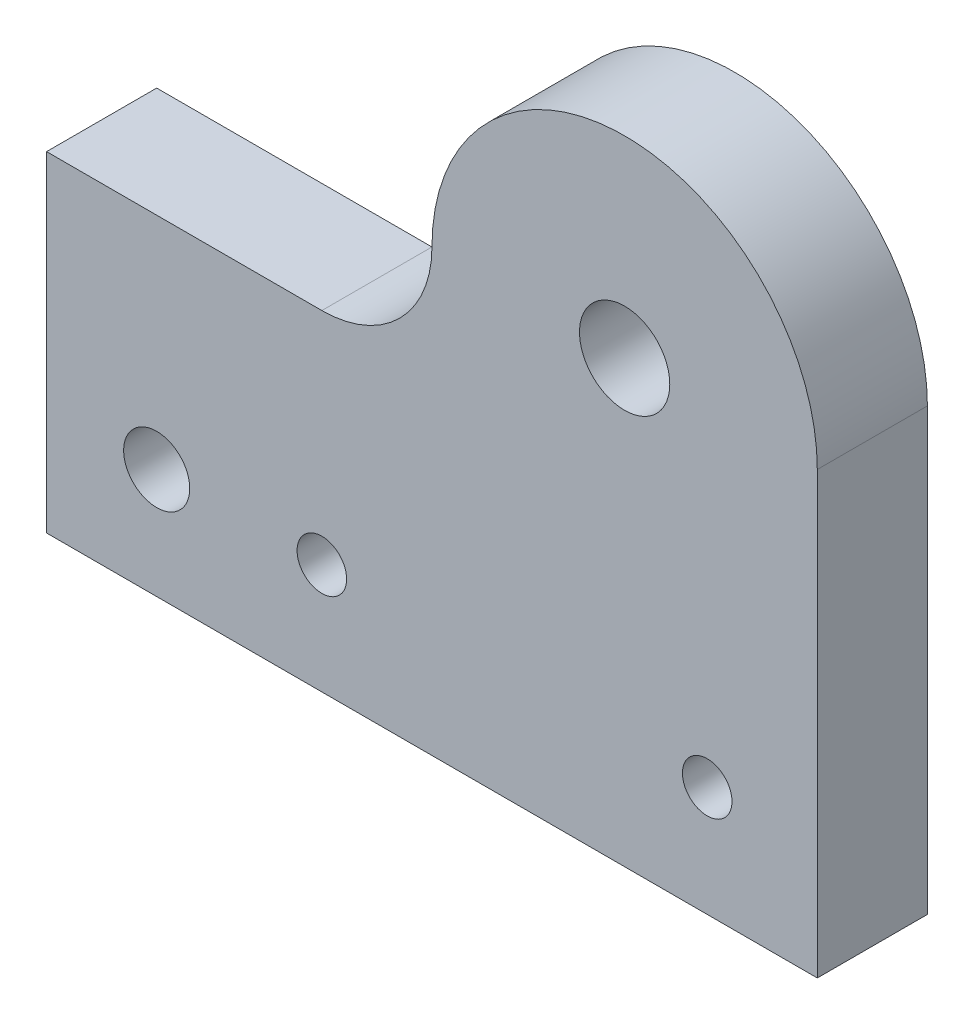
ISO-10303-21;
HEADER;
FILE_DESCRIPTION(('STEP AP214'),'2;1');
FILE_NAME('part.step','',(''),(''),'','','');
FILE_SCHEMA(('AUTOMOTIVE_DESIGN { 1 0 10303 214 1 1 1 1 }'));
ENDSEC;
DATA;
#1=APPLICATION_CONTEXT('core data for automotive mechanical design processes');
#2=APPLICATION_PROTOCOL_DEFINITION('international standard','automotive_design',2000,#1);
#3=PRODUCT_CONTEXT('',#1,'mechanical');
#4=PRODUCT('Part','Part','',(#3));
#5=PRODUCT_RELATED_PRODUCT_CATEGORY('part','',(#4));
#6=PRODUCT_DEFINITION_FORMATION('','',#4);
#7=PRODUCT_DEFINITION_CONTEXT('part definition',#1,'design');
#8=PRODUCT_DEFINITION('design','',#6,#7);
#9=PRODUCT_DEFINITION_SHAPE('','',#8);
#10=(LENGTH_UNIT() NAMED_UNIT(*) SI_UNIT(.MILLI.,.METRE.));
#11=(NAMED_UNIT(*) PLANE_ANGLE_UNIT() SI_UNIT($,.RADIAN.));
#12=(NAMED_UNIT(*) SI_UNIT($,.STERADIAN.) SOLID_ANGLE_UNIT());
#13=UNCERTAINTY_MEASURE_WITH_UNIT(LENGTH_MEASURE(1.E-05),#10,'distance_accuracy_value','');
#14=(GEOMETRIC_REPRESENTATION_CONTEXT(3) GLOBAL_UNCERTAINTY_ASSIGNED_CONTEXT((#13)) GLOBAL_UNIT_ASSIGNED_CONTEXT((#10,
#11,#12)) REPRESENTATION_CONTEXT('',''));
#15=CARTESIAN_POINT('',(0.,0.,0.));
#16=DIRECTION('',(0.,0.,1.));
#17=DIRECTION('',(1.,0.,0.));
#18=AXIS2_PLACEMENT_3D('',#15,#16,#17);
#19=CARTESIAN_POINT('',(17.5,25.,10.));
#20=DIRECTION('',(0.,0.,1.));
#21=DIRECTION('',(1.,0.,0.));
#22=AXIS2_PLACEMENT_3D('',#19,#20,#21);
#23=PLANE('',#22);
#24=CARTESIAN_POINT('',(-10.,-5.,10.));
#25=DIRECTION('',(0.,0.,1.));
#26=DIRECTION('',(1.,0.,0.));
#27=AXIS2_PLACEMENT_3D('',#24,#25,#26);
#28=CIRCLE('',#27,2.25);
#29=CARTESIAN_POINT('',(-7.75,-5.,10.));
#30=VERTEX_POINT('',#29);
#31=EDGE_CURVE('E191',#30,#30,#28,.T.);
#32=ORIENTED_EDGE('',*,*,#31,.F.);
#33=EDGE_LOOP('',(#32));
#34=FACE_BOUND('',#33,.T.);
#35=CARTESIAN_POINT('',(17.5,25.,10.));
#36=DIRECTION('',(0.,0.,1.));
#37=DIRECTION('',(1.,0.,0.));
#38=AXIS2_PLACEMENT_3D('',#35,#36,#37);
#39=CIRCLE('',#38,4.1);
#40=CARTESIAN_POINT('',(21.6,25.,10.));
#41=VERTEX_POINT('',#40);
#42=EDGE_CURVE('E123',#41,#41,#39,.T.);
#43=ORIENTED_EDGE('',*,*,#42,.F.);
#44=EDGE_LOOP('',(#43));
#45=FACE_BOUND('',#44,.T.);
#46=DIRECTION('',(0.,-1.,0.));
#47=VECTOR('',#46,1.);
#48=CARTESIAN_POINT('',(-35.,15.,10.));
#49=LINE('',#48,#47);
#50=CARTESIAN_POINT('',(-35.,15.,10.));
#51=VERTEX_POINT('',#50);
#52=CARTESIAN_POINT('',(-35.,-15.,10.));
#53=VERTEX_POINT('',#52);
#54=EDGE_CURVE('E131',#51,#53,#49,.T.);
#55=ORIENTED_EDGE('',*,*,#54,.T.);
#56=DIRECTION('',(1.,0.,0.));
#57=VECTOR('',#56,1.);
#58=CARTESIAN_POINT('',(-35.,-15.,10.));
#59=LINE('',#58,#57);
#60=CARTESIAN_POINT('',(35.,-15.,10.));
#61=VERTEX_POINT('',#60);
#62=EDGE_CURVE('E88',#53,#61,#59,.T.);
#63=ORIENTED_EDGE('',*,*,#62,.T.);
#64=DIRECTION('',(0.,1.,0.));
#65=VECTOR('',#64,1.);
#66=CARTESIAN_POINT('',(35.,15.,10.));
#67=LINE('',#66,#65);
#68=CARTESIAN_POINT('',(35.,25.,10.));
#69=VERTEX_POINT('',#68);
#70=EDGE_CURVE('E101',#61,#69,#67,.T.);
#71=ORIENTED_EDGE('',*,*,#70,.T.);
#72=CARTESIAN_POINT('',(17.5,25.,10.));
#73=DIRECTION('',(0.,0.,1.));
#74=DIRECTION('',(1.,0.,0.));
#75=AXIS2_PLACEMENT_3D('',#72,#73,#74);
#76=CIRCLE('',#75,17.5);
#77=CARTESIAN_POINT('',(0.,25.,10.));
#78=VERTEX_POINT('',#77);
#79=EDGE_CURVE('E95',#69,#78,#76,.T.);
#80=ORIENTED_EDGE('',*,*,#79,.T.);
#81=CARTESIAN_POINT('',(-10.,25.,10.));
#82=DIRECTION('',(0.,0.,-1.));
#83=DIRECTION('',(1.,0.,0.));
#84=AXIS2_PLACEMENT_3D('',#81,#82,#83);
#85=CIRCLE('',#84,9.99999999999999);
#86=CARTESIAN_POINT('',(-10.0000000000001,15.,10.));
#87=VERTEX_POINT('',#86);
#88=EDGE_CURVE('E99',#78,#87,#85,.T.);
#89=ORIENTED_EDGE('',*,*,#88,.T.);
#90=DIRECTION('',(-1.,0.,0.));
#91=VECTOR('',#90,1.);
#92=CARTESIAN_POINT('',(-35.,15.,10.));
#93=LINE('',#92,#91);
#94=EDGE_CURVE('E51',#87,#51,#93,.T.);
#95=ORIENTED_EDGE('',*,*,#94,.T.);
#96=EDGE_LOOP('',(#55,#63,#71,#80,#89,#95));
#97=FACE_BOUND('',#96,.T.);
#98=CARTESIAN_POINT('',(-25.,-5.,10.));
#99=DIRECTION('',(0.,0.,1.));
#100=DIRECTION('',(1.,0.,0.));
#101=AXIS2_PLACEMENT_3D('',#98,#99,#100);
#102=CIRCLE('',#101,3.);
#103=CARTESIAN_POINT('',(-22.,-5.,10.));
#104=VERTEX_POINT('',#103);
#105=EDGE_CURVE('E197',#104,#104,#102,.T.);
#106=ORIENTED_EDGE('',*,*,#105,.F.);
#107=EDGE_LOOP('',(#106));
#108=FACE_BOUND('',#107,.T.);
#109=CARTESIAN_POINT('',(25.,-5.,10.));
#110=DIRECTION('',(0.,0.,1.));
#111=DIRECTION('',(1.,0.,0.));
#112=AXIS2_PLACEMENT_3D('',#109,#110,#111);
#113=CIRCLE('',#112,2.25);
#114=CARTESIAN_POINT('',(27.25,-5.,10.));
#115=VERTEX_POINT('',#114);
#116=EDGE_CURVE('E182',#115,#115,#113,.T.);
#117=ORIENTED_EDGE('',*,*,#116,.F.);
#118=EDGE_LOOP('',(#117));
#119=FACE_BOUND('',#118,.T.);
#120=ADVANCED_FACE('F34',(#34,#45,#97,#108,#119),#23,.T.);
#121=CARTESIAN_POINT('',(17.5,25.,0.));
#122=DIRECTION('',(0.,0.,1.));
#123=DIRECTION('',(1.,0.,0.));
#124=AXIS2_PLACEMENT_3D('',#121,#122,#123);
#125=PLANE('',#124);
#126=DIRECTION('',(0.,-1.,0.));
#127=VECTOR('',#126,1.);
#128=CARTESIAN_POINT('',(-35.,15.,0.));
#129=LINE('',#128,#127);
#130=CARTESIAN_POINT('',(-35.,15.,0.));
#131=VERTEX_POINT('',#130);
#132=CARTESIAN_POINT('',(-35.,-15.,0.));
#133=VERTEX_POINT('',#132);
#134=EDGE_CURVE('E119',#131,#133,#129,.T.);
#135=ORIENTED_EDGE('',*,*,#134,.F.);
#136=DIRECTION('',(-1.,0.,0.));
#137=VECTOR('',#136,1.);
#138=CARTESIAN_POINT('',(-35.,15.,0.));
#139=LINE('',#138,#137);
#140=CARTESIAN_POINT('',(-10.0000000000001,15.,0.));
#141=VERTEX_POINT('',#140);
#142=EDGE_CURVE('E80',#141,#131,#139,.T.);
#143=ORIENTED_EDGE('',*,*,#142,.F.);
#144=CARTESIAN_POINT('',(-10.,25.,0.));
#145=DIRECTION('',(0.,0.,-1.));
#146=DIRECTION('',(1.,0.,0.));
#147=AXIS2_PLACEMENT_3D('',#144,#145,#146);
#148=CIRCLE('',#147,9.99999999999999);
#149=CARTESIAN_POINT('',(0.,25.,0.));
#150=VERTEX_POINT('',#149);
#151=EDGE_CURVE('E74',#150,#141,#148,.T.);
#152=ORIENTED_EDGE('',*,*,#151,.F.);
#153=CARTESIAN_POINT('',(17.5,25.,0.));
#154=DIRECTION('',(0.,0.,1.));
#155=DIRECTION('',(1.,0.,0.));
#156=AXIS2_PLACEMENT_3D('',#153,#154,#155);
#157=CIRCLE('',#156,17.5);
#158=CARTESIAN_POINT('',(35.,25.,0.));
#159=VERTEX_POINT('',#158);
#160=EDGE_CURVE('E109',#159,#150,#157,.T.);
#161=ORIENTED_EDGE('',*,*,#160,.F.);
#162=DIRECTION('',(0.,1.,0.));
#163=VECTOR('',#162,1.);
#164=CARTESIAN_POINT('',(35.,25.,0.));
#165=LINE('',#164,#163);
#166=CARTESIAN_POINT('',(35.,-15.,0.));
#167=VERTEX_POINT('',#166);
#168=EDGE_CURVE('E126',#167,#159,#165,.T.);
#169=ORIENTED_EDGE('',*,*,#168,.F.);
#170=DIRECTION('',(1.,0.,0.));
#171=VECTOR('',#170,1.);
#172=CARTESIAN_POINT('',(-35.,-15.,0.));
#173=LINE('',#172,#171);
#174=EDGE_CURVE('E122',#133,#167,#173,.T.);
#175=ORIENTED_EDGE('',*,*,#174,.F.);
#176=EDGE_LOOP('',(#135,#143,#152,#161,#169,#175));
#177=FACE_BOUND('',#176,.T.);
#178=CARTESIAN_POINT('',(17.5,25.,0.));
#179=DIRECTION('',(0.,0.,1.));
#180=DIRECTION('',(1.,0.,0.));
#181=AXIS2_PLACEMENT_3D('',#178,#179,#180);
#182=CIRCLE('',#181,4.1);
#183=CARTESIAN_POINT('',(21.6,25.,0.));
#184=VERTEX_POINT('',#183);
#185=EDGE_CURVE('E200',#184,#184,#182,.T.);
#186=ORIENTED_EDGE('',*,*,#185,.T.);
#187=EDGE_LOOP('',(#186));
#188=FACE_BOUND('',#187,.T.);
#189=CARTESIAN_POINT('',(-25.,-5.,0.));
#190=DIRECTION('',(0.,0.,1.));
#191=DIRECTION('',(1.,0.,0.));
#192=AXIS2_PLACEMENT_3D('',#189,#190,#191);
#193=CIRCLE('',#192,3.);
#194=CARTESIAN_POINT('',(-22.,-5.,0.));
#195=VERTEX_POINT('',#194);
#196=EDGE_CURVE('E194',#195,#195,#193,.T.);
#197=ORIENTED_EDGE('',*,*,#196,.T.);
#198=EDGE_LOOP('',(#197));
#199=FACE_BOUND('',#198,.T.);
#200=CARTESIAN_POINT('',(-10.,-5.,0.));
#201=DIRECTION('',(0.,0.,1.));
#202=DIRECTION('',(1.,0.,0.));
#203=AXIS2_PLACEMENT_3D('',#200,#201,#202);
#204=CIRCLE('',#203,2.25);
#205=CARTESIAN_POINT('',(-7.75,-5.,0.));
#206=VERTEX_POINT('',#205);
#207=EDGE_CURVE('E188',#206,#206,#204,.T.);
#208=ORIENTED_EDGE('',*,*,#207,.T.);
#209=EDGE_LOOP('',(#208));
#210=FACE_BOUND('',#209,.T.);
#211=CARTESIAN_POINT('',(25.,-5.,0.));
#212=DIRECTION('',(0.,0.,1.));
#213=DIRECTION('',(1.,0.,0.));
#214=AXIS2_PLACEMENT_3D('',#211,#212,#213);
#215=CIRCLE('',#214,2.25);
#216=CARTESIAN_POINT('',(27.25,-5.,0.));
#217=VERTEX_POINT('',#216);
#218=EDGE_CURVE('E185',#217,#217,#215,.T.);
#219=ORIENTED_EDGE('',*,*,#218,.T.);
#220=EDGE_LOOP('',(#219));
#221=FACE_BOUND('',#220,.T.);
#222=ADVANCED_FACE('F141',(#177,#188,#199,#210,#221),#125,.F.);
#223=CARTESIAN_POINT('',(-35.,15.,10.));
#224=DIRECTION('',(1.,0.,0.));
#225=DIRECTION('',(0.,0.,-1.));
#226=AXIS2_PLACEMENT_3D('',#223,#224,#225);
#227=PLANE('',#226);
#228=ORIENTED_EDGE('',*,*,#134,.T.);
#229=DIRECTION('',(0.,0.,-1.));
#230=VECTOR('',#229,1.);
#231=CARTESIAN_POINT('',(-35.,-15.,10.));
#232=LINE('',#231,#230);
#233=EDGE_CURVE('E11',#53,#133,#232,.T.);
#234=ORIENTED_EDGE('',*,*,#233,.F.);
#235=ORIENTED_EDGE('',*,*,#54,.F.);
#236=DIRECTION('',(0.,0.,-1.));
#237=VECTOR('',#236,1.);
#238=CARTESIAN_POINT('',(-35.,15.,10.));
#239=LINE('',#238,#237);
#240=EDGE_CURVE('E115',#51,#131,#239,.T.);
#241=ORIENTED_EDGE('',*,*,#240,.T.);
#242=EDGE_LOOP('',(#228,#234,#235,#241));
#243=FACE_BOUND('',#242,.T.);
#244=ADVANCED_FACE('F36',(#243),#227,.F.);
#245=CARTESIAN_POINT('',(-35.,-15.,10.));
#246=DIRECTION('',(0.,1.,0.));
#247=DIRECTION('',(-1.,0.,0.));
#248=AXIS2_PLACEMENT_3D('',#245,#246,#247);
#249=PLANE('',#248);
#250=ORIENTED_EDGE('',*,*,#174,.T.);
#251=DIRECTION('',(0.,0.,-1.));
#252=VECTOR('',#251,1.);
#253=CARTESIAN_POINT('',(35.,-15.,10.));
#254=LINE('',#253,#252);
#255=EDGE_CURVE('E43',#61,#167,#254,.T.);
#256=ORIENTED_EDGE('',*,*,#255,.F.);
#257=ORIENTED_EDGE('',*,*,#62,.F.);
#258=ORIENTED_EDGE('',*,*,#233,.T.);
#259=EDGE_LOOP('',(#250,#256,#257,#258));
#260=FACE_BOUND('',#259,.T.);
#261=ADVANCED_FACE('F137',(#260),#249,.F.);
#262=CARTESIAN_POINT('',(35.,25.,10.));
#263=DIRECTION('',(-1.,0.,0.));
#264=DIRECTION('',(0.,0.,1.));
#265=AXIS2_PLACEMENT_3D('',#262,#263,#264);
#266=PLANE('',#265);
#267=ORIENTED_EDGE('',*,*,#168,.T.);
#268=DIRECTION('',(0.,0.,-1.));
#269=VECTOR('',#268,1.);
#270=CARTESIAN_POINT('',(35.,25.,10.));
#271=LINE('',#270,#269);
#272=EDGE_CURVE('E110',#69,#159,#271,.T.);
#273=ORIENTED_EDGE('',*,*,#272,.F.);
#274=ORIENTED_EDGE('',*,*,#70,.F.);
#275=ORIENTED_EDGE('',*,*,#255,.T.);
#276=EDGE_LOOP('',(#267,#273,#274,#275));
#277=FACE_BOUND('',#276,.T.);
#278=ADVANCED_FACE('F136',(#277),#266,.F.);
#279=CARTESIAN_POINT('',(17.5,25.,10.));
#280=DIRECTION('',(0.,0.,-1.));
#281=DIRECTION('',(-1.,0.,0.));
#282=AXIS2_PLACEMENT_3D('',#279,#280,#281);
#283=CYLINDRICAL_SURFACE('',#282,17.5);
#284=ORIENTED_EDGE('',*,*,#160,.T.);
#285=DIRECTION('',(0.,0.,-1.));
#286=VECTOR('',#285,1.);
#287=CARTESIAN_POINT('',(0.,25.,10.));
#288=LINE('',#287,#286);
#289=EDGE_CURVE('E106',#78,#150,#288,.T.);
#290=ORIENTED_EDGE('',*,*,#289,.F.);
#291=ORIENTED_EDGE('',*,*,#79,.F.);
#292=ORIENTED_EDGE('',*,*,#272,.T.);
#293=EDGE_LOOP('',(#284,#290,#291,#292));
#294=FACE_BOUND('',#293,.T.);
#295=ADVANCED_FACE('F107',(#294),#283,.T.);
#296=CARTESIAN_POINT('',(-10.,25.,10.));
#297=DIRECTION('',(0.,0.,-1.));
#298=DIRECTION('',(-1.,0.,0.));
#299=AXIS2_PLACEMENT_3D('',#296,#297,#298);
#300=CYLINDRICAL_SURFACE('',#299,9.99999999999999);
#301=ORIENTED_EDGE('',*,*,#151,.T.);
#302=DIRECTION('',(0.,0.,-1.));
#303=VECTOR('',#302,1.);
#304=CARTESIAN_POINT('',(-10.0000000000001,15.,10.));
#305=LINE('',#304,#303);
#306=EDGE_CURVE('E111',#87,#141,#305,.T.);
#307=ORIENTED_EDGE('',*,*,#306,.F.);
#308=ORIENTED_EDGE('',*,*,#88,.F.);
#309=ORIENTED_EDGE('',*,*,#289,.T.);
#310=EDGE_LOOP('',(#301,#307,#308,#309));
#311=FACE_BOUND('',#310,.T.);
#312=ADVANCED_FACE('F113',(#311),#300,.F.);
#313=CARTESIAN_POINT('',(-35.,15.,10.));
#314=DIRECTION('',(0.,-1.,0.));
#315=DIRECTION('',(1.,0.,0.));
#316=AXIS2_PLACEMENT_3D('',#313,#314,#315);
#317=PLANE('',#316);
#318=ORIENTED_EDGE('',*,*,#142,.T.);
#319=ORIENTED_EDGE('',*,*,#240,.F.);
#320=ORIENTED_EDGE('',*,*,#94,.F.);
#321=ORIENTED_EDGE('',*,*,#306,.T.);
#322=EDGE_LOOP('',(#318,#319,#320,#321));
#323=FACE_BOUND('',#322,.T.);
#324=ADVANCED_FACE('F145',(#323),#317,.F.);
#325=CARTESIAN_POINT('',(17.5,25.,10.));
#326=DIRECTION('',(0.,0.,-1.));
#327=DIRECTION('',(-1.,0.,0.));
#328=AXIS2_PLACEMENT_3D('',#325,#326,#327);
#329=CYLINDRICAL_SURFACE('',#328,4.1);
#330=ORIENTED_EDGE('',*,*,#42,.T.);
#331=EDGE_LOOP('',(#330));
#332=FACE_BOUND('',#331,.T.);
#333=ORIENTED_EDGE('',*,*,#185,.F.);
#334=EDGE_LOOP('',(#333));
#335=FACE_BOUND('',#334,.T.);
#336=ADVANCED_FACE('F147',(#332,#335),#329,.F.);
#337=CARTESIAN_POINT('',(-25.,-5.,10.));
#338=DIRECTION('',(0.,0.,-1.));
#339=DIRECTION('',(-1.,0.,0.));
#340=AXIS2_PLACEMENT_3D('',#337,#338,#339);
#341=CYLINDRICAL_SURFACE('',#340,3.);
#342=ORIENTED_EDGE('',*,*,#105,.T.);
#343=EDGE_LOOP('',(#342));
#344=FACE_BOUND('',#343,.T.);
#345=ORIENTED_EDGE('',*,*,#196,.F.);
#346=EDGE_LOOP('',(#345));
#347=FACE_BOUND('',#346,.T.);
#348=ADVANCED_FACE('F153',(#344,#347),#341,.F.);
#349=CARTESIAN_POINT('',(-10.,-5.,10.));
#350=DIRECTION('',(0.,0.,-1.));
#351=DIRECTION('',(-1.,0.,0.));
#352=AXIS2_PLACEMENT_3D('',#349,#350,#351);
#353=CYLINDRICAL_SURFACE('',#352,2.25);
#354=ORIENTED_EDGE('',*,*,#31,.T.);
#355=EDGE_LOOP('',(#354));
#356=FACE_BOUND('',#355,.T.);
#357=ORIENTED_EDGE('',*,*,#207,.F.);
#358=EDGE_LOOP('',(#357));
#359=FACE_BOUND('',#358,.T.);
#360=ADVANCED_FACE('F169',(#356,#359),#353,.F.);
#361=CARTESIAN_POINT('',(25.,-5.,10.));
#362=DIRECTION('',(0.,0.,-1.));
#363=DIRECTION('',(-1.,0.,0.));
#364=AXIS2_PLACEMENT_3D('',#361,#362,#363);
#365=CYLINDRICAL_SURFACE('',#364,2.25);
#366=ORIENTED_EDGE('',*,*,#116,.T.);
#367=EDGE_LOOP('',(#366));
#368=FACE_BOUND('',#367,.T.);
#369=ORIENTED_EDGE('',*,*,#218,.F.);
#370=EDGE_LOOP('',(#369));
#371=FACE_BOUND('',#370,.T.);
#372=ADVANCED_FACE('F173',(#368,#371),#365,.F.);
#373=CLOSED_SHELL('',(#120,#222,#244,#261,#278,#295,#312,#324,#336,#348,#360,#372));
#374=MANIFOLD_SOLID_BREP('B2',#373);
#375=ADVANCED_BREP_SHAPE_REPRESENTATION('',(#18,#374),#14);
#376=SHAPE_DEFINITION_REPRESENTATION(#9,#375);
ENDSEC;
END-ISO-10303-21;
